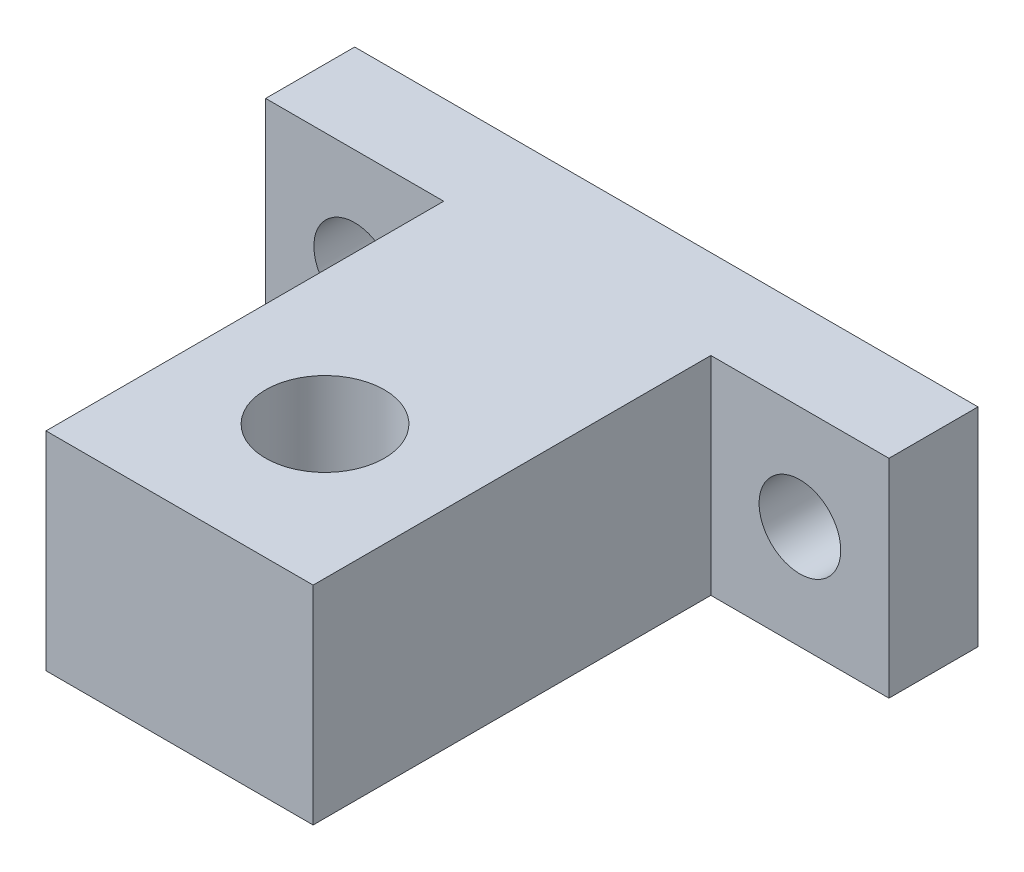
ISO-10303-21;
HEADER;
FILE_DESCRIPTION(('STEP AP214'),'2;1');
FILE_NAME('part.step','',(''),(''),'','','');
FILE_SCHEMA(('AUTOMOTIVE_DESIGN { 1 0 10303 214 1 1 1 1 }'));
ENDSEC;
DATA;
#1=APPLICATION_CONTEXT('core data for automotive mechanical design processes');
#2=APPLICATION_PROTOCOL_DEFINITION('international standard','automotive_design',2000,#1);
#3=PRODUCT_CONTEXT('',#1,'mechanical');
#4=PRODUCT('Part','Part','',(#3));
#5=PRODUCT_RELATED_PRODUCT_CATEGORY('part','',(#4));
#6=PRODUCT_DEFINITION_FORMATION('','',#4);
#7=PRODUCT_DEFINITION_CONTEXT('part definition',#1,'design');
#8=PRODUCT_DEFINITION('design','',#6,#7);
#9=PRODUCT_DEFINITION_SHAPE('','',#8);
#10=(LENGTH_UNIT() NAMED_UNIT(*) SI_UNIT(.MILLI.,.METRE.));
#11=(NAMED_UNIT(*) PLANE_ANGLE_UNIT() SI_UNIT($,.RADIAN.));
#12=(NAMED_UNIT(*) SI_UNIT($,.STERADIAN.) SOLID_ANGLE_UNIT());
#13=UNCERTAINTY_MEASURE_WITH_UNIT(LENGTH_MEASURE(1.E-05),#10,'distance_accuracy_value','');
#14=(GEOMETRIC_REPRESENTATION_CONTEXT(3) GLOBAL_UNCERTAINTY_ASSIGNED_CONTEXT((#13)) GLOBAL_UNIT_ASSIGNED_CONTEXT((#10,
#11,#12)) REPRESENTATION_CONTEXT('',''));
#15=CARTESIAN_POINT('',(0.,0.,0.));
#16=DIRECTION('',(0.,0.,1.));
#17=DIRECTION('',(1.,0.,0.));
#18=AXIS2_PLACEMENT_3D('',#15,#16,#17);
#19=CARTESIAN_POINT('',(-9.,14.,29.8));
#20=DIRECTION('',(0.,0.,-1.));
#21=DIRECTION('',(-1.,0.,0.));
#22=AXIS2_PLACEMENT_3D('',#19,#20,#21);
#23=PLANE('',#22);
#24=DIRECTION('',(1.,0.,0.));
#25=VECTOR('',#24,1.);
#26=CARTESIAN_POINT('',(-9.,0.,29.8));
#27=LINE('',#26,#25);
#28=CARTESIAN_POINT('',(-9.,0.,29.8));
#29=VERTEX_POINT('',#28);
#30=CARTESIAN_POINT('',(9.,0.,29.8));
#31=VERTEX_POINT('',#30);
#32=EDGE_CURVE('E131',#29,#31,#27,.T.);
#33=ORIENTED_EDGE('',*,*,#32,.T.);
#34=DIRECTION('',(0.,-1.,0.));
#35=VECTOR('',#34,1.);
#36=CARTESIAN_POINT('',(9.,14.,29.8));
#37=LINE('',#36,#35);
#38=CARTESIAN_POINT('',(9.,14.,29.8));
#39=VERTEX_POINT('',#38);
#40=EDGE_CURVE('E11',#39,#31,#37,.T.);
#41=ORIENTED_EDGE('',*,*,#40,.F.);
#42=DIRECTION('',(1.,0.,0.));
#43=VECTOR('',#42,1.);
#44=CARTESIAN_POINT('',(-9.,14.,29.8));
#45=LINE('',#44,#43);
#46=CARTESIAN_POINT('',(-9.,14.,29.8));
#47=VERTEX_POINT('',#46);
#48=EDGE_CURVE('E150',#47,#39,#45,.T.);
#49=ORIENTED_EDGE('',*,*,#48,.F.);
#50=DIRECTION('',(0.,-1.,0.));
#51=VECTOR('',#50,1.);
#52=CARTESIAN_POINT('',(-9.,14.,29.8));
#53=LINE('',#52,#51);
#54=EDGE_CURVE('E49',#47,#29,#53,.T.);
#55=ORIENTED_EDGE('',*,*,#54,.T.);
#56=EDGE_LOOP('',(#33,#41,#49,#55));
#57=FACE_BOUND('',#56,.T.);
#58=ADVANCED_FACE('F33',(#57),#23,.F.);
#59=CARTESIAN_POINT('',(9.,14.,29.8));
#60=DIRECTION('',(-1.,0.,0.));
#61=DIRECTION('',(0.,0.,1.));
#62=AXIS2_PLACEMENT_3D('',#59,#60,#61);
#63=PLANE('',#62);
#64=DIRECTION('',(0.,0.,-1.));
#65=VECTOR('',#64,1.);
#66=CARTESIAN_POINT('',(9.,0.,29.8));
#67=LINE('',#66,#65);
#68=CARTESIAN_POINT('',(9.,0.,3.));
#69=VERTEX_POINT('',#68);
#70=EDGE_CURVE('E133',#31,#69,#67,.T.);
#71=ORIENTED_EDGE('',*,*,#70,.T.);
#72=DIRECTION('',(0.,-1.,0.));
#73=VECTOR('',#72,1.);
#74=CARTESIAN_POINT('',(9.,14.,3.));
#75=LINE('',#74,#73);
#76=CARTESIAN_POINT('',(9.,14.,3.));
#77=VERTEX_POINT('',#76);
#78=EDGE_CURVE('E41',#77,#69,#75,.T.);
#79=ORIENTED_EDGE('',*,*,#78,.F.);
#80=DIRECTION('',(0.,0.,-1.));
#81=VECTOR('',#80,1.);
#82=CARTESIAN_POINT('',(9.,14.,29.8));
#83=LINE('',#82,#81);
#84=EDGE_CURVE('E88',#39,#77,#83,.T.);
#85=ORIENTED_EDGE('',*,*,#84,.F.);
#86=ORIENTED_EDGE('',*,*,#40,.T.);
#87=EDGE_LOOP('',(#71,#79,#85,#86));
#88=FACE_BOUND('',#87,.T.);
#89=ADVANCED_FACE('F215',(#88),#63,.F.);
#90=CARTESIAN_POINT('',(9.,14.,3.));
#91=DIRECTION('',(0.,0.,-1.));
#92=DIRECTION('',(-1.,0.,0.));
#93=AXIS2_PLACEMENT_3D('',#90,#91,#92);
#94=PLANE('',#93);
#95=CARTESIAN_POINT('',(15.,7.,3.));
#96=DIRECTION('',(0.,0.,1.));
#97=DIRECTION('',(1.,0.,0.));
#98=AXIS2_PLACEMENT_3D('',#95,#96,#97);
#99=CIRCLE('',#98,2.75);
#100=CARTESIAN_POINT('',(17.75,7.,3.));
#101=VERTEX_POINT('',#100);
#102=EDGE_CURVE('E183',#101,#101,#99,.T.);
#103=ORIENTED_EDGE('',*,*,#102,.F.);
#104=EDGE_LOOP('',(#103));
#105=FACE_BOUND('',#104,.T.);
#106=DIRECTION('',(1.,0.,0.));
#107=VECTOR('',#106,1.);
#108=CARTESIAN_POINT('',(9.,0.,3.));
#109=LINE('',#108,#107);
#110=CARTESIAN_POINT('',(21.,0.,3.));
#111=VERTEX_POINT('',#110);
#112=EDGE_CURVE('E136',#69,#111,#109,.T.);
#113=ORIENTED_EDGE('',*,*,#112,.T.);
#114=DIRECTION('',(0.,-1.,0.));
#115=VECTOR('',#114,1.);
#116=CARTESIAN_POINT('',(21.,14.,3.));
#117=LINE('',#116,#115);
#118=CARTESIAN_POINT('',(21.,14.,3.));
#119=VERTEX_POINT('',#118);
#120=EDGE_CURVE('E156',#119,#111,#117,.T.);
#121=ORIENTED_EDGE('',*,*,#120,.F.);
#122=DIRECTION('',(1.,0.,0.));
#123=VECTOR('',#122,1.);
#124=CARTESIAN_POINT('',(9.,14.,3.));
#125=LINE('',#124,#123);
#126=EDGE_CURVE('E164',#77,#119,#125,.T.);
#127=ORIENTED_EDGE('',*,*,#126,.F.);
#128=ORIENTED_EDGE('',*,*,#78,.T.);
#129=EDGE_LOOP('',(#113,#121,#127,#128));
#130=FACE_BOUND('',#129,.T.);
#131=ADVANCED_FACE('F162',(#105,#130),#94,.F.);
#132=CARTESIAN_POINT('',(21.,14.,3.));
#133=DIRECTION('',(-1.,0.,0.));
#134=DIRECTION('',(0.,0.,1.));
#135=AXIS2_PLACEMENT_3D('',#132,#133,#134);
#136=PLANE('',#135);
#137=DIRECTION('',(0.,0.,-1.));
#138=VECTOR('',#137,1.);
#139=CARTESIAN_POINT('',(21.,0.,3.));
#140=LINE('',#139,#138);
#141=CARTESIAN_POINT('',(21.,0.,-3.));
#142=VERTEX_POINT('',#141);
#143=EDGE_CURVE('E138',#111,#142,#140,.T.);
#144=ORIENTED_EDGE('',*,*,#143,.T.);
#145=DIRECTION('',(0.,-1.,0.));
#146=VECTOR('',#145,1.);
#147=CARTESIAN_POINT('',(21.,14.,-3.));
#148=LINE('',#147,#146);
#149=CARTESIAN_POINT('',(21.,14.,-3.));
#150=VERTEX_POINT('',#149);
#151=EDGE_CURVE('E154',#150,#142,#148,.T.);
#152=ORIENTED_EDGE('',*,*,#151,.F.);
#153=DIRECTION('',(0.,0.,-1.));
#154=VECTOR('',#153,1.);
#155=CARTESIAN_POINT('',(21.,14.,3.));
#156=LINE('',#155,#154);
#157=EDGE_CURVE('E126',#119,#150,#156,.T.);
#158=ORIENTED_EDGE('',*,*,#157,.F.);
#159=ORIENTED_EDGE('',*,*,#120,.T.);
#160=EDGE_LOOP('',(#144,#152,#158,#159));
#161=FACE_BOUND('',#160,.T.);
#162=ADVANCED_FACE('F171',(#161),#136,.F.);
#163=CARTESIAN_POINT('',(-21.,14.,-3.));
#164=DIRECTION('',(0.,0.,-1.));
#165=DIRECTION('',(-1.,0.,0.));
#166=AXIS2_PLACEMENT_3D('',#163,#164,#165);
#167=PLANE('',#166);
#168=CARTESIAN_POINT('',(-15.,7.,-3.));
#169=DIRECTION('',(0.,0.,1.));
#170=DIRECTION('',(1.,0.,0.));
#171=AXIS2_PLACEMENT_3D('',#168,#169,#170);
#172=CIRCLE('',#171,2.75);
#173=CARTESIAN_POINT('',(-12.25,7.,-3.));
#174=VERTEX_POINT('',#173);
#175=EDGE_CURVE('E186',#174,#174,#172,.T.);
#176=ORIENTED_EDGE('',*,*,#175,.T.);
#177=EDGE_LOOP('',(#176));
#178=FACE_BOUND('',#177,.T.);
#179=CARTESIAN_POINT('',(15.,7.,-3.));
#180=DIRECTION('',(0.,0.,1.));
#181=DIRECTION('',(1.,0.,0.));
#182=AXIS2_PLACEMENT_3D('',#179,#180,#181);
#183=CIRCLE('',#182,2.75);
#184=CARTESIAN_POINT('',(17.75,7.,-3.));
#185=VERTEX_POINT('',#184);
#186=EDGE_CURVE('E180',#185,#185,#183,.T.);
#187=ORIENTED_EDGE('',*,*,#186,.T.);
#188=EDGE_LOOP('',(#187));
#189=FACE_BOUND('',#188,.T.);
#190=DIRECTION('',(1.,0.,0.));
#191=VECTOR('',#190,1.);
#192=CARTESIAN_POINT('',(-21.,0.,-3.));
#193=LINE('',#192,#191);
#194=CARTESIAN_POINT('',(-21.,0.,-3.));
#195=VERTEX_POINT('',#194);
#196=EDGE_CURVE('E141',#195,#142,#193,.T.);
#197=ORIENTED_EDGE('',*,*,#196,.F.);
#198=DIRECTION('',(0.,-1.,0.));
#199=VECTOR('',#198,1.);
#200=CARTESIAN_POINT('',(-21.,14.,-3.));
#201=LINE('',#200,#199);
#202=CARTESIAN_POINT('',(-21.,14.,-3.));
#203=VERTEX_POINT('',#202);
#204=EDGE_CURVE('E113',#203,#195,#201,.T.);
#205=ORIENTED_EDGE('',*,*,#204,.F.);
#206=DIRECTION('',(1.,0.,0.));
#207=VECTOR('',#206,1.);
#208=CARTESIAN_POINT('',(-21.,14.,-3.));
#209=LINE('',#208,#207);
#210=EDGE_CURVE('E124',#203,#150,#209,.T.);
#211=ORIENTED_EDGE('',*,*,#210,.T.);
#212=ORIENTED_EDGE('',*,*,#151,.T.);
#213=EDGE_LOOP('',(#197,#205,#211,#212));
#214=FACE_BOUND('',#213,.T.);
#215=ADVANCED_FACE('F195',(#178,#189,#214),#167,.T.);
#216=CARTESIAN_POINT('',(-21.,14.,3.));
#217=DIRECTION('',(-1.,0.,0.));
#218=DIRECTION('',(0.,0.,1.));
#219=AXIS2_PLACEMENT_3D('',#216,#217,#218);
#220=PLANE('',#219);
#221=DIRECTION('',(0.,0.,-1.));
#222=VECTOR('',#221,1.);
#223=CARTESIAN_POINT('',(-21.,0.,3.));
#224=LINE('',#223,#222);
#225=CARTESIAN_POINT('',(-21.,0.,3.));
#226=VERTEX_POINT('',#225);
#227=EDGE_CURVE('E110',#226,#195,#224,.T.);
#228=ORIENTED_EDGE('',*,*,#227,.F.);
#229=DIRECTION('',(0.,-1.,0.));
#230=VECTOR('',#229,1.);
#231=CARTESIAN_POINT('',(-21.,14.,3.));
#232=LINE('',#231,#230);
#233=CARTESIAN_POINT('',(-21.,14.,3.));
#234=VERTEX_POINT('',#233);
#235=EDGE_CURVE('E104',#234,#226,#232,.T.);
#236=ORIENTED_EDGE('',*,*,#235,.F.);
#237=DIRECTION('',(0.,0.,-1.));
#238=VECTOR('',#237,1.);
#239=CARTESIAN_POINT('',(-21.,14.,3.));
#240=LINE('',#239,#238);
#241=EDGE_CURVE('E108',#234,#203,#240,.T.);
#242=ORIENTED_EDGE('',*,*,#241,.T.);
#243=ORIENTED_EDGE('',*,*,#204,.T.);
#244=EDGE_LOOP('',(#228,#236,#242,#243));
#245=FACE_BOUND('',#244,.T.);
#246=ADVANCED_FACE('F106',(#245),#220,.T.);
#247=CARTESIAN_POINT('',(-21.,14.,3.));
#248=DIRECTION('',(0.,0.,-1.));
#249=DIRECTION('',(-1.,0.,0.));
#250=AXIS2_PLACEMENT_3D('',#247,#248,#249);
#251=PLANE('',#250);
#252=CARTESIAN_POINT('',(-15.,7.,3.));
#253=DIRECTION('',(0.,0.,1.));
#254=DIRECTION('',(1.,0.,0.));
#255=AXIS2_PLACEMENT_3D('',#252,#253,#254);
#256=CIRCLE('',#255,2.75);
#257=CARTESIAN_POINT('',(-12.25,7.,3.));
#258=VERTEX_POINT('',#257);
#259=EDGE_CURVE('E189',#258,#258,#256,.T.);
#260=ORIENTED_EDGE('',*,*,#259,.F.);
#261=EDGE_LOOP('',(#260));
#262=FACE_BOUND('',#261,.T.);
#263=DIRECTION('',(1.,0.,0.));
#264=VECTOR('',#263,1.);
#265=CARTESIAN_POINT('',(-21.,0.,3.));
#266=LINE('',#265,#264);
#267=CARTESIAN_POINT('',(-9.,0.,3.00000000000001));
#268=VERTEX_POINT('',#267);
#269=EDGE_CURVE('E145',#226,#268,#266,.T.);
#270=ORIENTED_EDGE('',*,*,#269,.T.);
#271=DIRECTION('',(0.,-1.,0.));
#272=VECTOR('',#271,1.);
#273=CARTESIAN_POINT('',(-9.,14.,3.00000000000001));
#274=LINE('',#273,#272);
#275=CARTESIAN_POINT('',(-9.,14.,3.00000000000001));
#276=VERTEX_POINT('',#275);
#277=EDGE_CURVE('E76',#276,#268,#274,.T.);
#278=ORIENTED_EDGE('',*,*,#277,.F.);
#279=DIRECTION('',(1.,0.,0.));
#280=VECTOR('',#279,1.);
#281=CARTESIAN_POINT('',(-21.,14.,3.));
#282=LINE('',#281,#280);
#283=EDGE_CURVE('E115',#234,#276,#282,.T.);
#284=ORIENTED_EDGE('',*,*,#283,.F.);
#285=ORIENTED_EDGE('',*,*,#235,.T.);
#286=EDGE_LOOP('',(#270,#278,#284,#285));
#287=FACE_BOUND('',#286,.T.);
#288=ADVANCED_FACE('F116',(#262,#287),#251,.F.);
#289=CARTESIAN_POINT('',(-9.,14.,29.8));
#290=DIRECTION('',(-1.,0.,0.));
#291=DIRECTION('',(0.,0.,1.));
#292=AXIS2_PLACEMENT_3D('',#289,#290,#291);
#293=PLANE('',#292);
#294=DIRECTION('',(0.,0.,-1.));
#295=VECTOR('',#294,1.);
#296=CARTESIAN_POINT('',(-9.,0.,29.8));
#297=LINE('',#296,#295);
#298=EDGE_CURVE('E147',#29,#268,#297,.T.);
#299=ORIENTED_EDGE('',*,*,#298,.F.);
#300=ORIENTED_EDGE('',*,*,#54,.F.);
#301=DIRECTION('',(0.,0.,-1.));
#302=VECTOR('',#301,1.);
#303=CARTESIAN_POINT('',(-9.,14.,29.8));
#304=LINE('',#303,#302);
#305=EDGE_CURVE('E119',#47,#276,#304,.T.);
#306=ORIENTED_EDGE('',*,*,#305,.T.);
#307=ORIENTED_EDGE('',*,*,#277,.T.);
#308=EDGE_LOOP('',(#299,#300,#306,#307));
#309=FACE_BOUND('',#308,.T.);
#310=ADVANCED_FACE('F206',(#309),#293,.T.);
#311=CARTESIAN_POINT('',(0.,14.,0.));
#312=DIRECTION('',(0.,1.,0.));
#313=DIRECTION('',(0.,0.,1.));
#314=AXIS2_PLACEMENT_3D('',#311,#312,#313);
#315=PLANE('',#314);
#316=CARTESIAN_POINT('',(0.,14.,20.));
#317=DIRECTION('',(0.,-1.,0.));
#318=DIRECTION('',(0.,0.,-1.));
#319=AXIS2_PLACEMENT_3D('',#316,#317,#318);
#320=CIRCLE('',#319,4.);
#321=CARTESIAN_POINT('',(0.,14.,16.));
#322=VERTEX_POINT('',#321);
#323=EDGE_CURVE('E134',#322,#322,#320,.T.);
#324=ORIENTED_EDGE('',*,*,#323,.T.);
#325=EDGE_LOOP('',(#324));
#326=FACE_BOUND('',#325,.T.);
#327=ORIENTED_EDGE('',*,*,#48,.T.);
#328=ORIENTED_EDGE('',*,*,#84,.T.);
#329=ORIENTED_EDGE('',*,*,#126,.T.);
#330=ORIENTED_EDGE('',*,*,#157,.T.);
#331=ORIENTED_EDGE('',*,*,#210,.F.);
#332=ORIENTED_EDGE('',*,*,#241,.F.);
#333=ORIENTED_EDGE('',*,*,#283,.T.);
#334=ORIENTED_EDGE('',*,*,#305,.F.);
#335=EDGE_LOOP('',(#327,#328,#329,#330,#331,#332,#333,#334));
#336=FACE_BOUND('',#335,.T.);
#337=ADVANCED_FACE('F122',(#326,#336),#315,.T.);
#338=CARTESIAN_POINT('',(0.,0.,0.));
#339=DIRECTION('',(0.,1.,0.));
#340=DIRECTION('',(0.,0.,1.));
#341=AXIS2_PLACEMENT_3D('',#338,#339,#340);
#342=PLANE('',#341);
#343=CARTESIAN_POINT('',(0.,0.,20.));
#344=DIRECTION('',(0.,-1.,0.));
#345=DIRECTION('',(0.,0.,-1.));
#346=AXIS2_PLACEMENT_3D('',#343,#344,#345);
#347=CIRCLE('',#346,4.);
#348=CARTESIAN_POINT('',(0.,0.,16.));
#349=VERTEX_POINT('',#348);
#350=EDGE_CURVE('E177',#349,#349,#347,.T.);
#351=ORIENTED_EDGE('',*,*,#350,.F.);
#352=EDGE_LOOP('',(#351));
#353=FACE_BOUND('',#352,.T.);
#354=ORIENTED_EDGE('',*,*,#32,.F.);
#355=ORIENTED_EDGE('',*,*,#298,.T.);
#356=ORIENTED_EDGE('',*,*,#269,.F.);
#357=ORIENTED_EDGE('',*,*,#227,.T.);
#358=ORIENTED_EDGE('',*,*,#196,.T.);
#359=ORIENTED_EDGE('',*,*,#143,.F.);
#360=ORIENTED_EDGE('',*,*,#112,.F.);
#361=ORIENTED_EDGE('',*,*,#70,.F.);
#362=EDGE_LOOP('',(#354,#355,#356,#357,#358,#359,#360,#361));
#363=FACE_BOUND('',#362,.T.);
#364=ADVANCED_FACE('F167',(#353,#363),#342,.F.);
#365=CARTESIAN_POINT('',(0.,14.,20.));
#366=DIRECTION('',(0.,-1.,0.));
#367=DIRECTION('',(0.,0.,-1.));
#368=AXIS2_PLACEMENT_3D('',#365,#366,#367);
#369=CYLINDRICAL_SURFACE('',#368,4.);
#370=ORIENTED_EDGE('',*,*,#323,.F.);
#371=EDGE_LOOP('',(#370));
#372=FACE_BOUND('',#371,.T.);
#373=ORIENTED_EDGE('',*,*,#350,.T.);
#374=EDGE_LOOP('',(#373));
#375=FACE_BOUND('',#374,.T.);
#376=ADVANCED_FACE('F265',(#372,#375),#369,.F.);
#377=CARTESIAN_POINT('',(15.,7.,-3.));
#378=DIRECTION('',(0.,0.,1.));
#379=DIRECTION('',(1.,0.,0.));
#380=AXIS2_PLACEMENT_3D('',#377,#378,#379);
#381=CYLINDRICAL_SURFACE('',#380,2.75);
#382=ORIENTED_EDGE('',*,*,#186,.F.);
#383=EDGE_LOOP('',(#382));
#384=FACE_BOUND('',#383,.T.);
#385=ORIENTED_EDGE('',*,*,#102,.T.);
#386=EDGE_LOOP('',(#385));
#387=FACE_BOUND('',#386,.T.);
#388=ADVANCED_FACE('F201',(#384,#387),#381,.F.);
#389=CARTESIAN_POINT('',(-15.,7.,-3.));
#390=DIRECTION('',(0.,0.,1.));
#391=DIRECTION('',(1.,0.,0.));
#392=AXIS2_PLACEMENT_3D('',#389,#390,#391);
#393=CYLINDRICAL_SURFACE('',#392,2.75);
#394=ORIENTED_EDGE('',*,*,#175,.F.);
#395=EDGE_LOOP('',(#394));
#396=FACE_BOUND('',#395,.T.);
#397=ORIENTED_EDGE('',*,*,#259,.T.);
#398=EDGE_LOOP('',(#397));
#399=FACE_BOUND('',#398,.T.);
#400=ADVANCED_FACE('F198',(#396,#399),#393,.F.);
#401=CLOSED_SHELL('',(#58,#89,#131,#162,#215,#246,#288,#310,#337,#364,#376,#388,#400));
#402=MANIFOLD_SOLID_BREP('B2',#401);
#403=ADVANCED_BREP_SHAPE_REPRESENTATION('',(#18,#402),#14);
#404=SHAPE_DEFINITION_REPRESENTATION(#9,#403);
ENDSEC;
END-ISO-10303-21;
